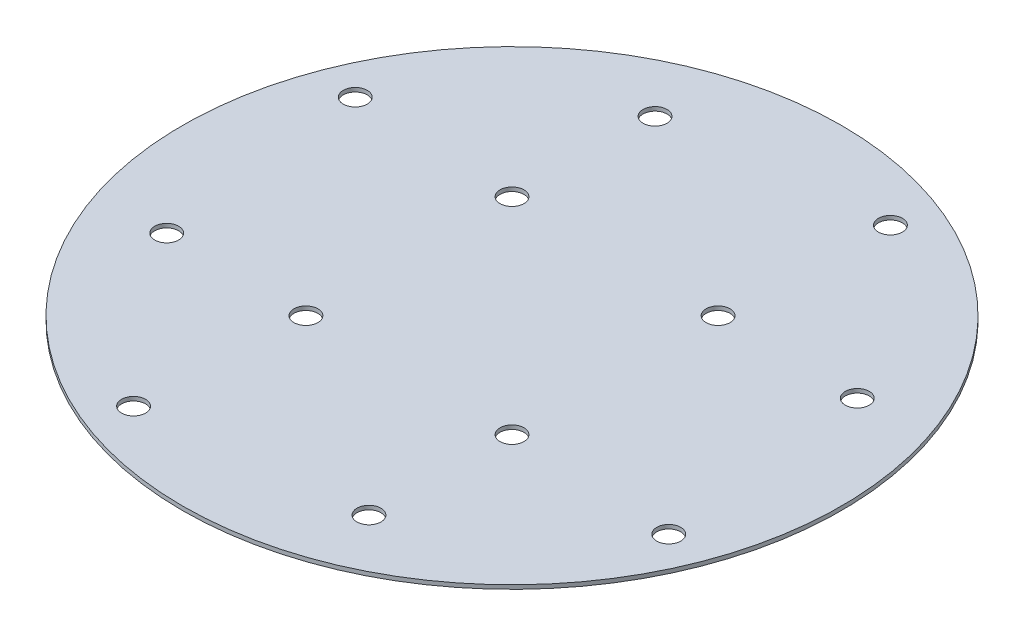
ISO-10303-21;
HEADER;
FILE_DESCRIPTION(('STEP AP214'),'2;1');
FILE_NAME('part.step','',(''),(''),'','','');
FILE_SCHEMA(('AUTOMOTIVE_DESIGN { 1 0 10303 214 1 1 1 1 }'));
ENDSEC;
DATA;
#1=APPLICATION_CONTEXT('core data for automotive mechanical design processes');
#2=APPLICATION_PROTOCOL_DEFINITION('international standard','automotive_design',2000,#1);
#3=PRODUCT_CONTEXT('',#1,'mechanical');
#4=PRODUCT('Part','Part','',(#3));
#5=PRODUCT_RELATED_PRODUCT_CATEGORY('part','',(#4));
#6=PRODUCT_DEFINITION_FORMATION('','',#4);
#7=PRODUCT_DEFINITION_CONTEXT('part definition',#1,'design');
#8=PRODUCT_DEFINITION('design','',#6,#7);
#9=PRODUCT_DEFINITION_SHAPE('','',#8);
#10=(LENGTH_UNIT() NAMED_UNIT(*) SI_UNIT(.MILLI.,.METRE.));
#11=(NAMED_UNIT(*) PLANE_ANGLE_UNIT() SI_UNIT($,.RADIAN.));
#12=(NAMED_UNIT(*) SI_UNIT($,.STERADIAN.) SOLID_ANGLE_UNIT());
#13=UNCERTAINTY_MEASURE_WITH_UNIT(LENGTH_MEASURE(1.E-05),#10,'distance_accuracy_value','');
#14=(GEOMETRIC_REPRESENTATION_CONTEXT(3) GLOBAL_UNCERTAINTY_ASSIGNED_CONTEXT((#13)) GLOBAL_UNIT_ASSIGNED_CONTEXT((#10,
#11,#12)) REPRESENTATION_CONTEXT('',''));
#15=CARTESIAN_POINT('',(0.,0.,0.));
#16=DIRECTION('',(0.,0.,1.));
#17=DIRECTION('',(1.,0.,0.));
#18=AXIS2_PLACEMENT_3D('',#15,#16,#17);
#19=CARTESIAN_POINT('',(0.,0.999999999999989,82.55));
#20=DIRECTION('',(0.,-1.,0.));
#21=DIRECTION('',(0.,0.,-1.));
#22=AXIS2_PLACEMENT_3D('',#19,#20,#21);
#23=PLANE('',#22);
#24=CARTESIAN_POINT('',(25.8093975133087,0.999999999999989,-25.8093975133093));
#25=DIRECTION('',(0.,1.,0.));
#26=DIRECTION('',(0.,0.,1.));
#27=AXIS2_PLACEMENT_3D('',#24,#25,#26);
#28=CIRCLE('',#27,2.999999969);
#29=CARTESIAN_POINT('',(25.8093975133087,0.999999999999989,-22.8093975443093));
#30=VERTEX_POINT('',#29);
#31=EDGE_CURVE('E106',#30,#30,#28,.T.);
#32=ORIENTED_EDGE('',*,*,#31,.F.);
#33=EDGE_LOOP('',(#32));
#34=FACE_BOUND('',#33,.T.);
#35=CARTESIAN_POINT('',(25.809397513309,0.999999999999989,25.8093975133089));
#36=DIRECTION('',(0.,1.,0.));
#37=DIRECTION('',(0.,0.,1.));
#38=AXIS2_PLACEMENT_3D('',#35,#36,#37);
#39=CIRCLE('',#38,2.999999969);
#40=CARTESIAN_POINT('',(25.809397513309,0.999999999999989,28.8093974823089));
#41=VERTEX_POINT('',#40);
#42=EDGE_CURVE('E88',#41,#41,#39,.T.);
#43=ORIENTED_EDGE('',*,*,#42,.F.);
#44=EDGE_LOOP('',(#43));
#45=FACE_BOUND('',#44,.T.);
#46=CARTESIAN_POINT('',(-27.7636830180869,0.999999999999989,67.027460083694));
#47=DIRECTION('',(0.,1.,0.));
#48=DIRECTION('',(0.,0.,1.));
#49=AXIS2_PLACEMENT_3D('',#46,#47,#48);
#50=CIRCLE('',#49,2.999999969);
#51=CARTESIAN_POINT('',(-27.7636830180869,0.999999999999989,70.027460052694));
#52=VERTEX_POINT('',#51);
#53=EDGE_CURVE('E76',#52,#52,#50,.T.);
#54=ORIENTED_EDGE('',*,*,#53,.F.);
#55=EDGE_LOOP('',(#54));
#56=FACE_BOUND('',#55,.T.);
#57=CARTESIAN_POINT('',(-25.8093975133088,0.999999999999989,25.8093975133091));
#58=DIRECTION('',(0.,1.,0.));
#59=DIRECTION('',(0.,0.,1.));
#60=AXIS2_PLACEMENT_3D('',#57,#58,#59);
#61=CIRCLE('',#60,2.999999969);
#62=CARTESIAN_POINT('',(-25.8093975133088,0.999999999999989,28.8093974823091));
#63=VERTEX_POINT('',#62);
#64=EDGE_CURVE('E70',#63,#63,#61,.T.);
#65=ORIENTED_EDGE('',*,*,#64,.F.);
#66=EDGE_LOOP('',(#65));
#67=FACE_BOUND('',#66,.T.);
#68=CARTESIAN_POINT('',(-25.333643222569,0.999999999999989,-61.1608250522472));
#69=DIRECTION('',(0.,1.,0.));
#70=DIRECTION('',(0.,0.,1.));
#71=AXIS2_PLACEMENT_3D('',#68,#69,#70);
#72=CIRCLE('',#71,2.999999969);
#73=CARTESIAN_POINT('',(-25.333643222569,0.999999999999989,-58.1608250832472));
#74=VERTEX_POINT('',#73);
#75=EDGE_CURVE('E64',#74,#74,#72,.T.);
#76=ORIENTED_EDGE('',*,*,#75,.F.);
#77=EDGE_LOOP('',(#76));
#78=FACE_BOUND('',#77,.T.);
#79=CARTESIAN_POINT('',(-67.0274600836939,0.999999999999989,-27.7636830180871));
#80=DIRECTION('',(0.,1.,0.));
#81=DIRECTION('',(0.,0.,1.));
#82=AXIS2_PLACEMENT_3D('',#79,#80,#81);
#83=CIRCLE('',#82,2.99999996899999);
#84=CARTESIAN_POINT('',(-67.0274600836939,0.999999999999989,-24.7636830490871));
#85=VERTEX_POINT('',#84);
#86=EDGE_CURVE('E58',#85,#85,#83,.T.);
#87=ORIENTED_EDGE('',*,*,#86,.F.);
#88=EDGE_LOOP('',(#87));
#89=FACE_BOUND('',#88,.T.);
#90=CARTESIAN_POINT('',(0.,0.99999999999999,0.));
#91=DIRECTION('',(0.,-1.,0.));
#92=DIRECTION('',(0.,0.,-1.));
#93=AXIS2_PLACEMENT_3D('',#90,#91,#92);
#94=CIRCLE('',#93,82.55);
#95=CARTESIAN_POINT('',(0.,0.99999999999999,-82.55));
#96=VERTEX_POINT('',#95);
#97=EDGE_CURVE('E42',#96,#96,#94,.T.);
#98=ORIENTED_EDGE('',*,*,#97,.F.);
#99=EDGE_LOOP('',(#98));
#100=FACE_BOUND('',#99,.T.);
#101=CARTESIAN_POINT('',(-25.809397513309,0.999999999999989,-25.8093975133089));
#102=DIRECTION('',(0.,1.,0.));
#103=DIRECTION('',(0.,0.,1.));
#104=AXIS2_PLACEMENT_3D('',#101,#102,#103);
#105=CIRCLE('',#104,2.999999969);
#106=CARTESIAN_POINT('',(-25.809397513309,0.999999999999989,-22.8093975443089));
#107=VERTEX_POINT('',#106);
#108=EDGE_CURVE('E50',#107,#107,#105,.T.);
#109=ORIENTED_EDGE('',*,*,#108,.F.);
#110=EDGE_LOOP('',(#109));
#111=FACE_BOUND('',#110,.T.);
#112=CARTESIAN_POINT('',(-61.1608250522471,0.999999999999989,25.3336432225692));
#113=DIRECTION('',(0.,1.,0.));
#114=DIRECTION('',(0.,0.,1.));
#115=AXIS2_PLACEMENT_3D('',#112,#113,#114);
#116=CIRCLE('',#115,2.999999969);
#117=CARTESIAN_POINT('',(-61.1608250522471,0.999999999999989,28.3336431915692));
#118=VERTEX_POINT('',#117);
#119=EDGE_CURVE('E82',#118,#118,#116,.T.);
#120=ORIENTED_EDGE('',*,*,#119,.F.);
#121=EDGE_LOOP('',(#120));
#122=FACE_BOUND('',#121,.T.);
#123=CARTESIAN_POINT('',(67.0274600836939,0.999999999999989,27.7636830180871));
#124=DIRECTION('',(0.,1.,0.));
#125=DIRECTION('',(0.,0.,1.));
#126=AXIS2_PLACEMENT_3D('',#123,#124,#125);
#127=CIRCLE('',#126,2.99999996899999);
#128=CARTESIAN_POINT('',(67.0274600836939,0.999999999999989,30.7636829870871));
#129=VERTEX_POINT('',#128);
#130=EDGE_CURVE('E94',#129,#129,#127,.T.);
#131=ORIENTED_EDGE('',*,*,#130,.F.);
#132=EDGE_LOOP('',(#131));
#133=FACE_BOUND('',#132,.T.);
#134=CARTESIAN_POINT('',(25.333643222569,0.999999999999989,61.1608250522472));
#135=DIRECTION('',(0.,1.,0.));
#136=DIRECTION('',(0.,0.,1.));
#137=AXIS2_PLACEMENT_3D('',#134,#135,#136);
#138=CIRCLE('',#137,2.999999969);
#139=CARTESIAN_POINT('',(25.333643222569,0.999999999999989,64.1608250212472));
#140=VERTEX_POINT('',#139);
#141=EDGE_CURVE('E100',#140,#140,#138,.T.);
#142=ORIENTED_EDGE('',*,*,#141,.F.);
#143=EDGE_LOOP('',(#142));
#144=FACE_BOUND('',#143,.T.);
#145=CARTESIAN_POINT('',(27.7636830180864,0.999999999999989,-67.0274600836942));
#146=DIRECTION('',(0.,1.,0.));
#147=DIRECTION('',(0.,0.,1.));
#148=AXIS2_PLACEMENT_3D('',#145,#146,#147);
#149=CIRCLE('',#148,2.999999969);
#150=CARTESIAN_POINT('',(27.7636830180864,0.999999999999989,-64.0274601146942));
#151=VERTEX_POINT('',#150);
#152=EDGE_CURVE('E112',#151,#151,#149,.T.);
#153=ORIENTED_EDGE('',*,*,#152,.F.);
#154=EDGE_LOOP('',(#153));
#155=FACE_BOUND('',#154,.T.);
#156=CARTESIAN_POINT('',(61.1608250522469,0.999999999999989,-25.3336432225696));
#157=DIRECTION('',(0.,1.,0.));
#158=DIRECTION('',(0.,0.,1.));
#159=AXIS2_PLACEMENT_3D('',#156,#157,#158);
#160=CIRCLE('',#159,2.999999969);
#161=CARTESIAN_POINT('',(61.1608250522469,0.999999999999989,-22.3336432535696));
#162=VERTEX_POINT('',#161);
#163=EDGE_CURVE('E118',#162,#162,#160,.T.);
#164=ORIENTED_EDGE('',*,*,#163,.F.);
#165=EDGE_LOOP('',(#164));
#166=FACE_BOUND('',#165,.T.);
#167=ADVANCED_FACE('F35',(#34,#45,#56,#67,#78,#89,#100,#111,#122,#133,#144,#155,#166),#23,.F.);
#168=CARTESIAN_POINT('',(0.,0.,0.));
#169=DIRECTION('',(0.,1.,0.));
#170=DIRECTION('',(0.,0.,1.));
#171=AXIS2_PLACEMENT_3D('',#168,#169,#170);
#172=PLANE('',#171);
#173=CARTESIAN_POINT('',(61.1608250522469,0.,-25.3336432225696));
#174=DIRECTION('',(0.,1.,0.));
#175=DIRECTION('',(0.,0.,1.));
#176=AXIS2_PLACEMENT_3D('',#173,#174,#175);
#177=CIRCLE('',#176,2.999999969);
#178=CARTESIAN_POINT('',(61.1608250522469,0.,-22.3336432535696));
#179=VERTEX_POINT('',#178);
#180=EDGE_CURVE('E115',#179,#179,#177,.T.);
#181=ORIENTED_EDGE('',*,*,#180,.T.);
#182=EDGE_LOOP('',(#181));
#183=FACE_BOUND('',#182,.T.);
#184=CARTESIAN_POINT('',(27.7636830180864,0.,-67.0274600836942));
#185=DIRECTION('',(0.,1.,0.));
#186=DIRECTION('',(0.,0.,1.));
#187=AXIS2_PLACEMENT_3D('',#184,#185,#186);
#188=CIRCLE('',#187,2.999999969);
#189=CARTESIAN_POINT('',(27.7636830180864,0.,-64.0274601146942));
#190=VERTEX_POINT('',#189);
#191=EDGE_CURVE('E109',#190,#190,#188,.T.);
#192=ORIENTED_EDGE('',*,*,#191,.T.);
#193=EDGE_LOOP('',(#192));
#194=FACE_BOUND('',#193,.T.);
#195=CARTESIAN_POINT('',(25.8093975133087,0.,-25.8093975133093));
#196=DIRECTION('',(0.,1.,0.));
#197=DIRECTION('',(0.,0.,1.));
#198=AXIS2_PLACEMENT_3D('',#195,#196,#197);
#199=CIRCLE('',#198,2.999999969);
#200=CARTESIAN_POINT('',(25.8093975133087,0.,-22.8093975443093));
#201=VERTEX_POINT('',#200);
#202=EDGE_CURVE('E103',#201,#201,#199,.T.);
#203=ORIENTED_EDGE('',*,*,#202,.T.);
#204=EDGE_LOOP('',(#203));
#205=FACE_BOUND('',#204,.T.);
#206=CARTESIAN_POINT('',(25.333643222569,0.,61.1608250522472));
#207=DIRECTION('',(0.,1.,0.));
#208=DIRECTION('',(0.,0.,1.));
#209=AXIS2_PLACEMENT_3D('',#206,#207,#208);
#210=CIRCLE('',#209,2.999999969);
#211=CARTESIAN_POINT('',(25.333643222569,0.,64.1608250212472));
#212=VERTEX_POINT('',#211);
#213=EDGE_CURVE('E97',#212,#212,#210,.T.);
#214=ORIENTED_EDGE('',*,*,#213,.T.);
#215=EDGE_LOOP('',(#214));
#216=FACE_BOUND('',#215,.T.);
#217=CARTESIAN_POINT('',(67.0274600836939,0.,27.7636830180871));
#218=DIRECTION('',(0.,1.,0.));
#219=DIRECTION('',(0.,0.,1.));
#220=AXIS2_PLACEMENT_3D('',#217,#218,#219);
#221=CIRCLE('',#220,2.99999996899999);
#222=CARTESIAN_POINT('',(67.0274600836939,0.,30.7636829870871));
#223=VERTEX_POINT('',#222);
#224=EDGE_CURVE('E91',#223,#223,#221,.T.);
#225=ORIENTED_EDGE('',*,*,#224,.T.);
#226=EDGE_LOOP('',(#225));
#227=FACE_BOUND('',#226,.T.);
#228=CARTESIAN_POINT('',(25.809397513309,0.,25.8093975133089));
#229=DIRECTION('',(0.,1.,0.));
#230=DIRECTION('',(0.,0.,1.));
#231=AXIS2_PLACEMENT_3D('',#228,#229,#230);
#232=CIRCLE('',#231,2.999999969);
#233=CARTESIAN_POINT('',(25.809397513309,0.,28.8093974823089));
#234=VERTEX_POINT('',#233);
#235=EDGE_CURVE('E85',#234,#234,#232,.T.);
#236=ORIENTED_EDGE('',*,*,#235,.T.);
#237=EDGE_LOOP('',(#236));
#238=FACE_BOUND('',#237,.T.);
#239=CARTESIAN_POINT('',(-61.1608250522471,0.,25.3336432225692));
#240=DIRECTION('',(0.,1.,0.));
#241=DIRECTION('',(0.,0.,1.));
#242=AXIS2_PLACEMENT_3D('',#239,#240,#241);
#243=CIRCLE('',#242,2.999999969);
#244=CARTESIAN_POINT('',(-61.1608250522471,0.,28.3336431915692));
#245=VERTEX_POINT('',#244);
#246=EDGE_CURVE('E79',#245,#245,#243,.T.);
#247=ORIENTED_EDGE('',*,*,#246,.T.);
#248=EDGE_LOOP('',(#247));
#249=FACE_BOUND('',#248,.T.);
#250=CARTESIAN_POINT('',(-27.7636830180869,0.,67.027460083694));
#251=DIRECTION('',(0.,1.,0.));
#252=DIRECTION('',(0.,0.,1.));
#253=AXIS2_PLACEMENT_3D('',#250,#251,#252);
#254=CIRCLE('',#253,2.999999969);
#255=CARTESIAN_POINT('',(-27.7636830180869,0.,70.027460052694));
#256=VERTEX_POINT('',#255);
#257=EDGE_CURVE('E73',#256,#256,#254,.T.);
#258=ORIENTED_EDGE('',*,*,#257,.T.);
#259=EDGE_LOOP('',(#258));
#260=FACE_BOUND('',#259,.T.);
#261=CARTESIAN_POINT('',(-25.8093975133088,0.,25.8093975133091));
#262=DIRECTION('',(0.,1.,0.));
#263=DIRECTION('',(0.,0.,1.));
#264=AXIS2_PLACEMENT_3D('',#261,#262,#263);
#265=CIRCLE('',#264,2.999999969);
#266=CARTESIAN_POINT('',(-25.8093975133088,0.,28.8093974823091));
#267=VERTEX_POINT('',#266);
#268=EDGE_CURVE('E67',#267,#267,#265,.T.);
#269=ORIENTED_EDGE('',*,*,#268,.T.);
#270=EDGE_LOOP('',(#269));
#271=FACE_BOUND('',#270,.T.);
#272=CARTESIAN_POINT('',(-25.333643222569,0.,-61.1608250522472));
#273=DIRECTION('',(0.,1.,0.));
#274=DIRECTION('',(0.,0.,1.));
#275=AXIS2_PLACEMENT_3D('',#272,#273,#274);
#276=CIRCLE('',#275,2.999999969);
#277=CARTESIAN_POINT('',(-25.333643222569,0.,-58.1608250832472));
#278=VERTEX_POINT('',#277);
#279=EDGE_CURVE('E61',#278,#278,#276,.T.);
#280=ORIENTED_EDGE('',*,*,#279,.T.);
#281=EDGE_LOOP('',(#280));
#282=FACE_BOUND('',#281,.T.);
#283=CARTESIAN_POINT('',(-67.0274600836939,0.,-27.7636830180871));
#284=DIRECTION('',(0.,1.,0.));
#285=DIRECTION('',(0.,0.,1.));
#286=AXIS2_PLACEMENT_3D('',#283,#284,#285);
#287=CIRCLE('',#286,2.99999996899999);
#288=CARTESIAN_POINT('',(-67.0274600836939,0.,-24.7636830490871));
#289=VERTEX_POINT('',#288);
#290=EDGE_CURVE('E55',#289,#289,#287,.T.);
#291=ORIENTED_EDGE('',*,*,#290,.T.);
#292=EDGE_LOOP('',(#291));
#293=FACE_BOUND('',#292,.T.);
#294=CARTESIAN_POINT('',(-25.809397513309,0.,-25.8093975133089));
#295=DIRECTION('',(0.,1.,0.));
#296=DIRECTION('',(0.,0.,1.));
#297=AXIS2_PLACEMENT_3D('',#294,#295,#296);
#298=CIRCLE('',#297,2.999999969);
#299=CARTESIAN_POINT('',(-25.809397513309,0.,-22.8093975443089));
#300=VERTEX_POINT('',#299);
#301=EDGE_CURVE('E46',#300,#300,#298,.T.);
#302=ORIENTED_EDGE('',*,*,#301,.T.);
#303=EDGE_LOOP('',(#302));
#304=FACE_BOUND('',#303,.T.);
#305=CARTESIAN_POINT('',(0.,0.,0.));
#306=DIRECTION('',(0.,-1.,0.));
#307=DIRECTION('',(0.,0.,-1.));
#308=AXIS2_PLACEMENT_3D('',#305,#306,#307);
#309=CIRCLE('',#308,82.55);
#310=CARTESIAN_POINT('',(0.,0.,-82.55));
#311=VERTEX_POINT('',#310);
#312=EDGE_CURVE('E10',#311,#311,#309,.T.);
#313=ORIENTED_EDGE('',*,*,#312,.T.);
#314=EDGE_LOOP('',(#313));
#315=FACE_BOUND('',#314,.T.);
#316=ADVANCED_FACE('F37',(#183,#194,#205,#216,#227,#238,#249,#260,#271,#282,#293,#304,#315),
#172,.F.);
#317=CARTESIAN_POINT('',(0.,-0.0500000000000102,0.));
#318=DIRECTION('',(0.,-1.,0.));
#319=DIRECTION('',(0.,0.,-1.));
#320=AXIS2_PLACEMENT_3D('',#317,#318,#319);
#321=CYLINDRICAL_SURFACE('',#320,82.55);
#322=ORIENTED_EDGE('',*,*,#312,.F.);
#323=EDGE_LOOP('',(#322));
#324=FACE_BOUND('',#323,.T.);
#325=ORIENTED_EDGE('',*,*,#97,.T.);
#326=EDGE_LOOP('',(#325));
#327=FACE_BOUND('',#326,.T.);
#328=ADVANCED_FACE('F130',(#324,#327),#321,.T.);
#329=CARTESIAN_POINT('',(-25.809397513309,0.999999999999989,-25.8093975133089));
#330=DIRECTION('',(0.,1.,0.));
#331=DIRECTION('',(0.,0.,1.));
#332=AXIS2_PLACEMENT_3D('',#329,#330,#331);
#333=CYLINDRICAL_SURFACE('',#332,2.999999969);
#334=ORIENTED_EDGE('',*,*,#301,.F.);
#335=EDGE_LOOP('',(#334));
#336=FACE_BOUND('',#335,.T.);
#337=ORIENTED_EDGE('',*,*,#108,.T.);
#338=EDGE_LOOP('',(#337));
#339=FACE_BOUND('',#338,.T.);
#340=ADVANCED_FACE('F135',(#336,#339),#333,.F.);
#341=CARTESIAN_POINT('',(-67.0274600836939,0.999999999999989,-27.7636830180871));
#342=DIRECTION('',(0.,1.,0.));
#343=DIRECTION('',(0.,0.,1.));
#344=AXIS2_PLACEMENT_3D('',#341,#342,#343);
#345=CYLINDRICAL_SURFACE('',#344,2.99999996899999);
#346=ORIENTED_EDGE('',*,*,#290,.F.);
#347=EDGE_LOOP('',(#346));
#348=FACE_BOUND('',#347,.T.);
#349=ORIENTED_EDGE('',*,*,#86,.T.);
#350=EDGE_LOOP('',(#349));
#351=FACE_BOUND('',#350,.T.);
#352=ADVANCED_FACE('F142',(#348,#351),#345,.F.);
#353=CARTESIAN_POINT('',(-25.333643222569,0.999999999999989,-61.1608250522472));
#354=DIRECTION('',(0.,1.,0.));
#355=DIRECTION('',(0.,0.,1.));
#356=AXIS2_PLACEMENT_3D('',#353,#354,#355);
#357=CYLINDRICAL_SURFACE('',#356,2.999999969);
#358=ORIENTED_EDGE('',*,*,#279,.F.);
#359=EDGE_LOOP('',(#358));
#360=FACE_BOUND('',#359,.T.);
#361=ORIENTED_EDGE('',*,*,#75,.T.);
#362=EDGE_LOOP('',(#361));
#363=FACE_BOUND('',#362,.T.);
#364=ADVANCED_FACE('F147',(#360,#363),#357,.F.);
#365=CARTESIAN_POINT('',(-25.8093975133088,0.999999999999989,25.8093975133091));
#366=DIRECTION('',(0.,1.,0.));
#367=DIRECTION('',(0.,0.,1.));
#368=AXIS2_PLACEMENT_3D('',#365,#366,#367);
#369=CYLINDRICAL_SURFACE('',#368,2.999999969);
#370=ORIENTED_EDGE('',*,*,#268,.F.);
#371=EDGE_LOOP('',(#370));
#372=FACE_BOUND('',#371,.T.);
#373=ORIENTED_EDGE('',*,*,#64,.T.);
#374=EDGE_LOOP('',(#373));
#375=FACE_BOUND('',#374,.T.);
#376=ADVANCED_FACE('F196',(#372,#375),#369,.F.);
#377=CARTESIAN_POINT('',(-27.7636830180869,0.999999999999989,67.027460083694));
#378=DIRECTION('',(0.,1.,0.));
#379=DIRECTION('',(0.,0.,1.));
#380=AXIS2_PLACEMENT_3D('',#377,#378,#379);
#381=CYLINDRICAL_SURFACE('',#380,2.999999969);
#382=ORIENTED_EDGE('',*,*,#257,.F.);
#383=EDGE_LOOP('',(#382));
#384=FACE_BOUND('',#383,.T.);
#385=ORIENTED_EDGE('',*,*,#53,.T.);
#386=EDGE_LOOP('',(#385));
#387=FACE_BOUND('',#386,.T.);
#388=ADVANCED_FACE('F192',(#384,#387),#381,.F.);
#389=CARTESIAN_POINT('',(-61.1608250522471,0.999999999999989,25.3336432225692));
#390=DIRECTION('',(0.,1.,0.));
#391=DIRECTION('',(0.,0.,1.));
#392=AXIS2_PLACEMENT_3D('',#389,#390,#391);
#393=CYLINDRICAL_SURFACE('',#392,2.999999969);
#394=ORIENTED_EDGE('',*,*,#246,.F.);
#395=EDGE_LOOP('',(#394));
#396=FACE_BOUND('',#395,.T.);
#397=ORIENTED_EDGE('',*,*,#119,.T.);
#398=EDGE_LOOP('',(#397));
#399=FACE_BOUND('',#398,.T.);
#400=ADVANCED_FACE('F188',(#396,#399),#393,.F.);
#401=CARTESIAN_POINT('',(25.809397513309,0.999999999999989,25.8093975133089));
#402=DIRECTION('',(0.,1.,0.));
#403=DIRECTION('',(0.,0.,1.));
#404=AXIS2_PLACEMENT_3D('',#401,#402,#403);
#405=CYLINDRICAL_SURFACE('',#404,2.999999969);
#406=ORIENTED_EDGE('',*,*,#235,.F.);
#407=EDGE_LOOP('',(#406));
#408=FACE_BOUND('',#407,.T.);
#409=ORIENTED_EDGE('',*,*,#42,.T.);
#410=EDGE_LOOP('',(#409));
#411=FACE_BOUND('',#410,.T.);
#412=ADVANCED_FACE('F184',(#408,#411),#405,.F.);
#413=CARTESIAN_POINT('',(67.0274600836939,0.999999999999989,27.7636830180871));
#414=DIRECTION('',(0.,1.,0.));
#415=DIRECTION('',(0.,0.,1.));
#416=AXIS2_PLACEMENT_3D('',#413,#414,#415);
#417=CYLINDRICAL_SURFACE('',#416,2.99999996899999);
#418=ORIENTED_EDGE('',*,*,#224,.F.);
#419=EDGE_LOOP('',(#418));
#420=FACE_BOUND('',#419,.T.);
#421=ORIENTED_EDGE('',*,*,#130,.T.);
#422=EDGE_LOOP('',(#421));
#423=FACE_BOUND('',#422,.T.);
#424=ADVANCED_FACE('F180',(#420,#423),#417,.F.);
#425=CARTESIAN_POINT('',(25.333643222569,0.999999999999989,61.1608250522472));
#426=DIRECTION('',(0.,1.,0.));
#427=DIRECTION('',(0.,0.,1.));
#428=AXIS2_PLACEMENT_3D('',#425,#426,#427);
#429=CYLINDRICAL_SURFACE('',#428,2.999999969);
#430=ORIENTED_EDGE('',*,*,#213,.F.);
#431=EDGE_LOOP('',(#430));
#432=FACE_BOUND('',#431,.T.);
#433=ORIENTED_EDGE('',*,*,#141,.T.);
#434=EDGE_LOOP('',(#433));
#435=FACE_BOUND('',#434,.T.);
#436=ADVANCED_FACE('F173',(#432,#435),#429,.F.);
#437=CARTESIAN_POINT('',(25.8093975133087,0.999999999999989,-25.8093975133093));
#438=DIRECTION('',(0.,1.,0.));
#439=DIRECTION('',(0.,0.,1.));
#440=AXIS2_PLACEMENT_3D('',#437,#438,#439);
#441=CYLINDRICAL_SURFACE('',#440,2.999999969);
#442=ORIENTED_EDGE('',*,*,#202,.F.);
#443=EDGE_LOOP('',(#442));
#444=FACE_BOUND('',#443,.T.);
#445=ORIENTED_EDGE('',*,*,#31,.T.);
#446=EDGE_LOOP('',(#445));
#447=FACE_BOUND('',#446,.T.);
#448=ADVANCED_FACE('F164',(#444,#447),#441,.F.);
#449=CARTESIAN_POINT('',(27.7636830180864,0.999999999999989,-67.0274600836942));
#450=DIRECTION('',(0.,1.,0.));
#451=DIRECTION('',(0.,0.,1.));
#452=AXIS2_PLACEMENT_3D('',#449,#450,#451);
#453=CYLINDRICAL_SURFACE('',#452,2.999999969);
#454=ORIENTED_EDGE('',*,*,#191,.F.);
#455=EDGE_LOOP('',(#454));
#456=FACE_BOUND('',#455,.T.);
#457=ORIENTED_EDGE('',*,*,#152,.T.);
#458=EDGE_LOOP('',(#457));
#459=FACE_BOUND('',#458,.T.);
#460=ADVANCED_FACE('F162',(#456,#459),#453,.F.);
#461=CARTESIAN_POINT('',(61.1608250522469,0.999999999999989,-25.3336432225696));
#462=DIRECTION('',(0.,1.,0.));
#463=DIRECTION('',(0.,0.,1.));
#464=AXIS2_PLACEMENT_3D('',#461,#462,#463);
#465=CYLINDRICAL_SURFACE('',#464,2.999999969);
#466=ORIENTED_EDGE('',*,*,#180,.F.);
#467=EDGE_LOOP('',(#466));
#468=FACE_BOUND('',#467,.T.);
#469=ORIENTED_EDGE('',*,*,#163,.T.);
#470=EDGE_LOOP('',(#469));
#471=FACE_BOUND('',#470,.T.);
#472=ADVANCED_FACE('F122',(#468,#471),#465,.F.);
#473=CLOSED_SHELL('',(#167,#316,#328,#340,#352,#364,#376,#388,#400,#412,#424,#436,#448,#460,#472));
#474=MANIFOLD_SOLID_BREP('B2',#473);
#475=ADVANCED_BREP_SHAPE_REPRESENTATION('',(#18,#474),#14);
#476=SHAPE_DEFINITION_REPRESENTATION(#9,#475);
ENDSEC;
END-ISO-10303-21;
